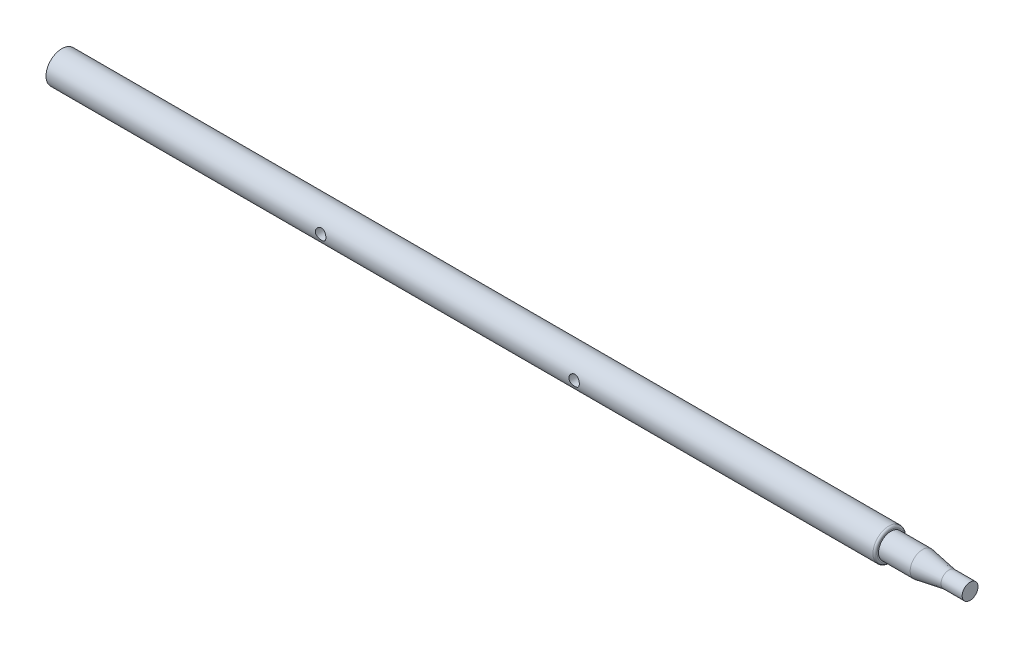
ISO-10303-21;
HEADER;
FILE_DESCRIPTION(('STEP AP214'),'2;1');
FILE_NAME('part.step','',(''),(''),'','','');
FILE_SCHEMA(('AUTOMOTIVE_DESIGN { 1 0 10303 214 1 1 1 1 }'));
ENDSEC;
DATA;
#1=APPLICATION_CONTEXT('core data for automotive mechanical design processes');
#2=APPLICATION_PROTOCOL_DEFINITION('international standard','automotive_design',2000,#1);
#3=PRODUCT_CONTEXT('',#1,'mechanical');
#4=PRODUCT('Part','Part','',(#3));
#5=PRODUCT_RELATED_PRODUCT_CATEGORY('part','',(#4));
#6=PRODUCT_DEFINITION_FORMATION('','',#4);
#7=PRODUCT_DEFINITION_CONTEXT('part definition',#1,'design');
#8=PRODUCT_DEFINITION('design','',#6,#7);
#9=PRODUCT_DEFINITION_SHAPE('','',#8);
#10=(LENGTH_UNIT() NAMED_UNIT(*) SI_UNIT(.MILLI.,.METRE.));
#11=(NAMED_UNIT(*) PLANE_ANGLE_UNIT() SI_UNIT($,.RADIAN.));
#12=(NAMED_UNIT(*) SI_UNIT($,.STERADIAN.) SOLID_ANGLE_UNIT());
#13=UNCERTAINTY_MEASURE_WITH_UNIT(LENGTH_MEASURE(1.E-05),#10,'distance_accuracy_value','');
#14=(GEOMETRIC_REPRESENTATION_CONTEXT(3) GLOBAL_UNCERTAINTY_ASSIGNED_CONTEXT((#13)) GLOBAL_UNIT_ASSIGNED_CONTEXT((#10,
#11,#12)) REPRESENTATION_CONTEXT('',''));
#15=CARTESIAN_POINT('',(0.,0.,0.));
#16=DIRECTION('',(0.,0.,1.));
#17=DIRECTION('',(1.,0.,0.));
#18=AXIS2_PLACEMENT_3D('',#15,#16,#17);
#19=CARTESIAN_POINT('',(77.2277227722772,0.,0.));
#20=DIRECTION('',(-1.,0.,0.));
#21=DIRECTION('',(0.,0.,1.));
#22=AXIS2_PLACEMENT_3D('',#19,#20,#21);
#23=PLANE('',#22);
#24=CARTESIAN_POINT('',(77.2277227722772,0.,0.));
#25=DIRECTION('',(-1.,0.,0.));
#26=DIRECTION('',(0.,0.,1.));
#27=AXIS2_PLACEMENT_3D('',#24,#25,#26);
#28=CIRCLE('',#27,7.5);
#29=CARTESIAN_POINT('',(77.2277227722772,0.,7.5));
#30=VERTEX_POINT('',#29);
#31=EDGE_CURVE('E101',#30,#30,#28,.T.);
#32=ORIENTED_EDGE('',*,*,#31,.F.);
#33=EDGE_LOOP('',(#32));
#34=FACE_BOUND('',#33,.T.);
#35=ADVANCED_FACE('F39',(#34),#23,.F.);
#36=CARTESIAN_POINT('',(-782.772277227723,0.,0.));
#37=DIRECTION('',(-1.,0.,0.));
#38=DIRECTION('',(0.,0.,1.));
#39=AXIS2_PLACEMENT_3D('',#36,#37,#38);
#40=CYLINDRICAL_SURFACE('',#39,7.5);
#41=CARTESIAN_POINT('',(57.2277227722772,0.,0.));
#42=DIRECTION('',(-1.,0.,0.));
#43=DIRECTION('',(0.,0.,1.));
#44=AXIS2_PLACEMENT_3D('',#41,#42,#43);
#45=CIRCLE('',#44,7.5);
#46=CARTESIAN_POINT('',(57.2277227722772,0.,7.5));
#47=VERTEX_POINT('',#46);
#48=EDGE_CURVE('E105',#47,#47,#45,.T.);
#49=ORIENTED_EDGE('',*,*,#48,.F.);
#50=EDGE_LOOP('',(#49));
#51=FACE_BOUND('',#50,.T.);
#52=ORIENTED_EDGE('',*,*,#31,.T.);
#53=EDGE_LOOP('',(#52));
#54=FACE_BOUND('',#53,.T.);
#55=ADVANCED_FACE('F132',(#51,#54),#40,.T.);
#56=CARTESIAN_POINT('',(57.2277227722772,0.,0.));
#57=DIRECTION('',(-1.,0.,0.));
#58=DIRECTION('',(0.,0.,1.));
#59=AXIS2_PLACEMENT_3D('',#56,#57,#58);
#60=CONICAL_SURFACE('',#59,7.5,0.167716477901566);
#61=CARTESIAN_POINT('',(32.2277227722771,0.,0.));
#62=DIRECTION('',(-1.,0.,0.));
#63=DIRECTION('',(0.,0.,1.));
#64=AXIS2_PLACEMENT_3D('',#61,#62,#63);
#65=CIRCLE('',#64,11.7326732673267);
#66=CARTESIAN_POINT('',(32.2277227722771,0.,11.7326732673267));
#67=VERTEX_POINT('',#66);
#68=EDGE_CURVE('E109',#67,#67,#65,.T.);
#69=ORIENTED_EDGE('',*,*,#68,.F.);
#70=EDGE_LOOP('',(#69));
#71=FACE_BOUND('',#70,.T.);
#72=ORIENTED_EDGE('',*,*,#48,.T.);
#73=EDGE_LOOP('',(#72));
#74=FACE_BOUND('',#73,.T.);
#75=ADVANCED_FACE('F137',(#71,#74),#60,.T.);
#76=CARTESIAN_POINT('',(-782.772277227723,0.,0.));
#77=DIRECTION('',(-1.,0.,0.));
#78=DIRECTION('',(0.,0.,1.));
#79=AXIS2_PLACEMENT_3D('',#76,#77,#78);
#80=CYLINDRICAL_SURFACE('',#79,11.7326732673267);
#81=CARTESIAN_POINT('',(2.22772277227723,0.,0.));
#82=DIRECTION('',(-1.,0.,0.));
#83=DIRECTION('',(0.,0.,1.));
#84=AXIS2_PLACEMENT_3D('',#81,#82,#83);
#85=CIRCLE('',#84,11.7326732673267);
#86=CARTESIAN_POINT('',(2.22772277227723,0.,11.7326732673267));
#87=VERTEX_POINT('',#86);
#88=EDGE_CURVE('E113',#87,#87,#85,.T.);
#89=ORIENTED_EDGE('',*,*,#88,.F.);
#90=EDGE_LOOP('',(#89));
#91=FACE_BOUND('',#90,.T.);
#92=ORIENTED_EDGE('',*,*,#68,.T.);
#93=EDGE_LOOP('',(#92));
#94=FACE_BOUND('',#93,.T.);
#95=ADVANCED_FACE('F129',(#91,#94),#80,.T.);
#96=CARTESIAN_POINT('',(2.22772277227718,11.7326732673267,0.));
#97=DIRECTION('',(-1.,0.,0.));
#98=DIRECTION('',(0.,0.,1.));
#99=AXIS2_PLACEMENT_3D('',#96,#97,#98);
#100=PLANE('',#99);
#101=CARTESIAN_POINT('',(2.22772277227718,0.,0.));
#102=DIRECTION('',(-1.,0.,0.));
#103=DIRECTION('',(0.,0.,1.));
#104=AXIS2_PLACEMENT_3D('',#101,#102,#103);
#105=CIRCLE('',#104,13.);
#106=CARTESIAN_POINT('',(2.22772277227718,0.,13.));
#107=VERTEX_POINT('',#106);
#108=EDGE_CURVE('E93',#107,#107,#105,.F.);
#109=ORIENTED_EDGE('',*,*,#108,.T.);
#110=EDGE_LOOP('',(#109));
#111=FACE_BOUND('',#110,.T.);
#112=ORIENTED_EDGE('',*,*,#88,.T.);
#113=EDGE_LOOP('',(#112));
#114=FACE_BOUND('',#113,.T.);
#115=ADVANCED_FACE('F124',(#111,#114),#100,.F.);
#116=CARTESIAN_POINT('',(-782.772277227723,0.,0.));
#117=DIRECTION('',(-1.,0.,0.));
#118=DIRECTION('',(0.,0.,1.));
#119=AXIS2_PLACEMENT_3D('',#116,#117,#118);
#120=CYLINDRICAL_SURFACE('',#119,15.);
#121=CARTESIAN_POINT('',(-517.772277227723,0.,-15.));
#122=CARTESIAN_POINT('',(-517.772275959065,0.272816814433615,-15.0000007650471));
#123=CARTESIAN_POINT('',(-517.794678558359,0.545625972692736,-14.9924884753769));
#124=CARTESIAN_POINT('',(-517.883422771809,1.08320880436491,-14.9632605101644));
#125=CARTESIAN_POINT('',(-517.949768947468,1.3479816405942,-14.941543360109));
#126=CARTESIAN_POINT('',(-518.123873444643,1.86166394750877,-14.8862653953208));
#127=CARTESIAN_POINT('',(-518.231562540019,2.11059912942978,-14.8527243865376));
#128=CARTESIAN_POINT('',(-518.484983091915,2.58687468402706,-14.7772222858721));
#129=CARTESIAN_POINT('',(-518.630722052738,2.81421078479508,-14.7352595334076));
#130=CARTESIAN_POINT('',(-518.961406252014,3.24870837510977,-14.6457047221309));
#131=CARTESIAN_POINT('',(-519.147433399017,3.45501850148558,-14.5979778231161));
#132=CARTESIAN_POINT('',(-519.551113001264,3.83416346351653,-14.5030157392292));
#133=CARTESIAN_POINT('',(-519.768772402396,4.0069909274699,-14.4557806648006));
#134=CARTESIAN_POINT('',(-520.237202803678,4.319124711119,-14.3656666235818));
#135=CARTESIAN_POINT('',(-520.488745926274,4.4573242910225,-14.3229519627198));
#136=CARTESIAN_POINT('',(-521.013157699902,4.68909436930555,-14.2487652698844));
#137=CARTESIAN_POINT('',(-521.286019813501,4.78267848691248,-14.2172898077928));
#138=CARTESIAN_POINT('',(-521.835643335234,4.91936730756491,-14.1705651637056));
#139=CARTESIAN_POINT('',(-522.111963270182,4.96406724136039,-14.1548047884338));
#140=CARTESIAN_POINT('',(-522.668595998488,5.00670561667091,-14.1397828315221));
#141=CARTESIAN_POINT('',(-522.948907531239,5.00465850803663,-14.1405161515599));
#142=CARTESIAN_POINT('',(-523.491960379984,4.95509951850361,-14.1579507500054));
#143=CARTESIAN_POINT('',(-523.754919242441,4.90966956578094,-14.1739207918415));
#144=CARTESIAN_POINT('',(-524.269244325873,4.77803081419374,-14.2188328846856));
#145=CARTESIAN_POINT('',(-524.520609154925,4.69181713294746,-14.2477764887883));
#146=CARTESIAN_POINT('',(-525.009340975643,4.47969529031774,-14.3158955569847));
#147=CARTESIAN_POINT('',(-525.24641735506,4.35317024354083,-14.3552282897692));
#148=CARTESIAN_POINT('',(-525.696631769132,4.06444553151127,-14.4396279286729));
#149=CARTESIAN_POINT('',(-525.909762862393,3.90223556181882,-14.4846964894921));
#150=CARTESIAN_POINT('',(-526.317735218524,3.53674666341248,-14.5783664584198));
#151=CARTESIAN_POINT('',(-526.511040700267,3.3317657503819,-14.6270294677509));
#152=CARTESIAN_POINT('',(-526.860933561041,2.89169784984997,-14.7203469193431));
#153=CARTESIAN_POINT('',(-527.017517418545,2.65660797830397,-14.765000976901));
#154=CARTESIAN_POINT('',(-527.290758728898,2.15973806523143,-14.8458553968921));
#155=CARTESIAN_POINT('',(-527.407004684427,1.89771638208172,-14.8819675004026));
#156=CARTESIAN_POINT('',(-527.593293097501,1.35634541682252,-14.9410283572211));
#157=CARTESIAN_POINT('',(-527.66335160484,1.07700219077475,-14.9639816827438));
#158=CARTESIAN_POINT('',(-527.752555557835,0.521919147646505,-14.9933813535722));
#159=CARTESIAN_POINT('',(-527.773776273587,0.246547999324214,-15.0005000916864));
#160=CARTESIAN_POINT('',(-527.77061385973,-0.303875349801204,-14.9994451347413));
#161=CARTESIAN_POINT('',(-527.746238427824,-0.578927596598268,-14.9912740209681));
#162=CARTESIAN_POINT('',(-527.654217689043,-1.11259933152128,-14.9610012358552));
#163=CARTESIAN_POINT('',(-527.587846197475,-1.3714640341742,-14.9393099355596));
#164=CARTESIAN_POINT('',(-527.415310005389,-1.87427979289785,-14.8845923415035));
#165=CARTESIAN_POINT('',(-527.309140230384,-2.11822894254303,-14.8515646023337));
#166=CARTESIAN_POINT('',(-527.056925068519,-2.59144148196636,-14.7764465643645));
#167=CARTESIAN_POINT('',(-526.909904261307,-2.82014979608571,-14.7341407377893));
#168=CARTESIAN_POINT('',(-526.581306477655,-3.25032415067791,-14.6452626958131));
#169=CARTESIAN_POINT('',(-526.399718947564,-3.45178183897789,-14.5986891796914));
#170=CARTESIAN_POINT('',(-525.99738347269,-3.83126253903152,-14.5038423990222));
#171=CARTESIAN_POINT('',(-525.775231093089,-4.00780484622888,-14.4555880543714));
#172=CARTESIAN_POINT('',(-525.303419388668,-4.3212876116179,-14.3649986647354));
#173=CARTESIAN_POINT('',(-525.053759834552,-4.4582277396551,-14.3226636691001));
#174=CARTESIAN_POINT('',(-524.533912151273,-4.68798465208185,-14.2491195895692));
#175=CARTESIAN_POINT('',(-524.263766831879,-4.78089066082515,-14.2178880396489));
#176=CARTESIAN_POINT('',(-523.710383977502,-4.91947333379681,-14.1705416153225));
#177=CARTESIAN_POINT('',(-523.427152400701,-4.96517127476974,-14.154419931182));
#178=CARTESIAN_POINT('',(-522.871291747518,-5.00638141238676,-14.1398929437088));
#179=CARTESIAN_POINT('',(-522.598865526289,-5.00435128654204,-14.1406200128707));
#180=CARTESIAN_POINT('',(-522.058451853112,-4.95621146724351,-14.1575634911934));
#181=CARTESIAN_POINT('',(-521.790464137947,-4.91010439729298,-14.1737789784681));
#182=CARTESIAN_POINT('',(-521.27159891271,-4.77685906564678,-14.2192262152446));
#183=CARTESIAN_POINT('',(-521.0204931027,-4.69051673007763,-14.2482049011239));
#184=CARTESIAN_POINT('',(-520.536140193032,-4.47989682879881,-14.3158199409234));
#185=CARTESIAN_POINT('',(-520.302897071783,-4.3556108427691,-14.3544584381696));
#186=CARTESIAN_POINT('',(-519.849858878108,-4.06630346291722,-14.4391414613023));
#187=CARTESIAN_POINT('',(-519.631094718231,-3.89974121382297,-14.4854355821068));
#188=CARTESIAN_POINT('',(-519.223828160802,-3.53321441567832,-14.5791678141626));
#189=CARTESIAN_POINT('',(-519.035334349282,-3.33324042225749,-14.6266062456186));
#190=CARTESIAN_POINT('',(-518.686555166277,-2.89620778460353,-14.7195015262772));
#191=CARTESIAN_POINT('',(-518.527655488968,-2.65800756749873,-14.7648090900628));
#192=CARTESIAN_POINT('',(-518.252325083469,-2.15678678703319,-14.8462995586306));
#193=CARTESIAN_POINT('',(-518.135883498113,-1.89377259066178,-14.8824847953965));
#194=CARTESIAN_POINT('',(-517.953669065279,-1.3624682360049,-14.9402757534271));
#195=CARTESIAN_POINT('',(-517.885864896406,-1.09493878838207,-14.9624606211261));
#196=CARTESIAN_POINT('',(-517.795175824337,-0.551602080051252,-14.9923203532111));
#197=CARTESIAN_POINT('',(-517.77227851024,-0.275797127843735,-14.9999992265953));
#198=CARTESIAN_POINT('',(-517.772277227723,0.,-15.));
#199=B_SPLINE_CURVE_WITH_KNOTS('',3,(#121,#122,#123,#124,#125,#126,#127,#128,#129,#130,#131,
#132,#133,#134,#135,#136,#137,#138,#139,#140,#141,#142,#143,#144,#145,#146,#147,#148,#149,#150,
#151,#152,#153,#154,#155,#156,#157,#158,#159,#160,#161,#162,#163,#164,#165,#166,#167,#168,#169,
#170,#171,#172,#173,#174,#175,#176,#177,#178,#179,#180,#181,#182,#183,#184,#185,#186,#187,#188,
#189,#190,#191,#192,#193,#194,#195,#196,#197,#198),.UNSPECIFIED.,.T.,.F.,(4,2,2,2,2,2,2,2,2,2,2,
2,2,2,2,2,2,2,2,2,2,2,2,2,2,2,2,2,2,2,2,2,2,2,2,2,2,2,4),(0.,0.817435530130066,1.63495592633762,
2.45111336435139,3.26743188899552,4.10923421413787,4.95122166437655,5.81741924118914,
6.68335223467738,7.52009628712775,8.35658169941013,9.15484132763708,9.95319654288068,
10.7644085578631,11.575855128017,12.429665290675,13.2835572984376,14.1459202826245,
15.0079834439671,15.8326791588652,16.6572356583155,17.4579078990173,18.2586822643118,
19.0805199922935,19.9026090412012,20.7620511441443,21.6215004118566,22.4792006914453,
23.3365142353987,24.1497833033197,24.9630039676755,25.7607793541275,26.5587319089055,
27.3915033346969,28.2245105562956,29.0899830418617,29.9552340577296,30.7818279187974,
31.6081933020138),.UNSPECIFIED.);
#200=CARTESIAN_POINT('',(-517.772277227723,0.,-15.));
#201=VERTEX_POINT('',#200);
#202=EDGE_CURVE('E10',#201,#201,#199,.T.);
#203=ORIENTED_EDGE('',*,*,#202,.T.);
#204=EDGE_LOOP('',(#203));
#205=FACE_BOUND('',#204,.T.);
#206=CARTESIAN_POINT('',(-517.772277227723,0.,15.));
#207=CARTESIAN_POINT('',(-517.772275959065,-0.272816814433615,15.0000007650471));
#208=CARTESIAN_POINT('',(-517.794678558359,-0.545625972692736,14.9924884753769));
#209=CARTESIAN_POINT('',(-517.883422771809,-1.08320880436491,14.9632605101644));
#210=CARTESIAN_POINT('',(-517.949768947468,-1.3479816405942,14.941543360109));
#211=CARTESIAN_POINT('',(-518.123873444643,-1.86166394750877,14.8862653953208));
#212=CARTESIAN_POINT('',(-518.231562540019,-2.11059912942978,14.8527243865376));
#213=CARTESIAN_POINT('',(-518.484983091915,-2.58687468402706,14.7772222858721));
#214=CARTESIAN_POINT('',(-518.630722052738,-2.81421078479508,14.7352595334076));
#215=CARTESIAN_POINT('',(-518.961406252014,-3.24870837510977,14.6457047221309));
#216=CARTESIAN_POINT('',(-519.147433399017,-3.45501850148558,14.5979778231161));
#217=CARTESIAN_POINT('',(-519.551113001264,-3.83416346351653,14.5030157392292));
#218=CARTESIAN_POINT('',(-519.768772402396,-4.0069909274699,14.4557806648006));
#219=CARTESIAN_POINT('',(-520.237202803678,-4.319124711119,14.3656666235818));
#220=CARTESIAN_POINT('',(-520.488745926274,-4.4573242910225,14.3229519627198));
#221=CARTESIAN_POINT('',(-521.013157699902,-4.68909436930555,14.2487652698844));
#222=CARTESIAN_POINT('',(-521.286019813501,-4.78267848691248,14.2172898077928));
#223=CARTESIAN_POINT('',(-521.835643335234,-4.91936730756491,14.1705651637056));
#224=CARTESIAN_POINT('',(-522.111963270182,-4.96406724136039,14.1548047884338));
#225=CARTESIAN_POINT('',(-522.668595998488,-5.00670561667091,14.1397828315221));
#226=CARTESIAN_POINT('',(-522.948907531239,-5.00465850803663,14.1405161515599));
#227=CARTESIAN_POINT('',(-523.491960379984,-4.95509951850361,14.1579507500054));
#228=CARTESIAN_POINT('',(-523.754919242441,-4.90966956578094,14.1739207918415));
#229=CARTESIAN_POINT('',(-524.269244325873,-4.77803081419374,14.2188328846856));
#230=CARTESIAN_POINT('',(-524.520609154925,-4.69181713294746,14.2477764887883));
#231=CARTESIAN_POINT('',(-525.009340975643,-4.47969529031774,14.3158955569847));
#232=CARTESIAN_POINT('',(-525.24641735506,-4.35317024354083,14.3552282897692));
#233=CARTESIAN_POINT('',(-525.696631769132,-4.06444553151127,14.4396279286729));
#234=CARTESIAN_POINT('',(-525.909762862393,-3.90223556181882,14.4846964894921));
#235=CARTESIAN_POINT('',(-526.317735218524,-3.53674666341248,14.5783664584198));
#236=CARTESIAN_POINT('',(-526.511040700267,-3.3317657503819,14.6270294677509));
#237=CARTESIAN_POINT('',(-526.860933561041,-2.89169784984997,14.7203469193431));
#238=CARTESIAN_POINT('',(-527.017517418545,-2.65660797830397,14.765000976901));
#239=CARTESIAN_POINT('',(-527.290758728898,-2.15973806523143,14.8458553968921));
#240=CARTESIAN_POINT('',(-527.407004684427,-1.89771638208172,14.8819675004026));
#241=CARTESIAN_POINT('',(-527.593293097501,-1.35634541682252,14.9410283572211));
#242=CARTESIAN_POINT('',(-527.66335160484,-1.07700219077475,14.9639816827438));
#243=CARTESIAN_POINT('',(-527.752555557835,-0.521919147646505,14.9933813535722));
#244=CARTESIAN_POINT('',(-527.773776273587,-0.246547999324214,15.0005000916864));
#245=CARTESIAN_POINT('',(-527.77061385973,0.303875349801204,14.9994451347413));
#246=CARTESIAN_POINT('',(-527.746238427824,0.578927596598268,14.9912740209681));
#247=CARTESIAN_POINT('',(-527.654217689043,1.11259933152128,14.9610012358552));
#248=CARTESIAN_POINT('',(-527.587846197475,1.3714640341742,14.9393099355596));
#249=CARTESIAN_POINT('',(-527.415310005389,1.87427979289785,14.8845923415035));
#250=CARTESIAN_POINT('',(-527.309140230384,2.11822894254303,14.8515646023337));
#251=CARTESIAN_POINT('',(-527.056925068519,2.59144148196636,14.7764465643645));
#252=CARTESIAN_POINT('',(-526.909904261307,2.82014979608571,14.7341407377893));
#253=CARTESIAN_POINT('',(-526.581306477655,3.25032415067791,14.6452626958131));
#254=CARTESIAN_POINT('',(-526.399718947564,3.45178183897789,14.5986891796914));
#255=CARTESIAN_POINT('',(-525.99738347269,3.83126253903152,14.5038423990222));
#256=CARTESIAN_POINT('',(-525.775231093089,4.00780484622888,14.4555880543714));
#257=CARTESIAN_POINT('',(-525.303419388668,4.3212876116179,14.3649986647354));
#258=CARTESIAN_POINT('',(-525.053759834552,4.4582277396551,14.3226636691001));
#259=CARTESIAN_POINT('',(-524.533912151273,4.68798465208185,14.2491195895692));
#260=CARTESIAN_POINT('',(-524.263766831879,4.78089066082515,14.2178880396489));
#261=CARTESIAN_POINT('',(-523.710383977502,4.91947333379681,14.1705416153225));
#262=CARTESIAN_POINT('',(-523.427152400701,4.96517127476974,14.154419931182));
#263=CARTESIAN_POINT('',(-522.871291747518,5.00638141238676,14.1398929437088));
#264=CARTESIAN_POINT('',(-522.598865526289,5.00435128654204,14.1406200128707));
#265=CARTESIAN_POINT('',(-522.058451853112,4.95621146724351,14.1575634911934));
#266=CARTESIAN_POINT('',(-521.790464137947,4.91010439729298,14.1737789784681));
#267=CARTESIAN_POINT('',(-521.27159891271,4.77685906564678,14.2192262152446));
#268=CARTESIAN_POINT('',(-521.0204931027,4.69051673007763,14.2482049011239));
#269=CARTESIAN_POINT('',(-520.536140193032,4.47989682879881,14.3158199409234));
#270=CARTESIAN_POINT('',(-520.302897071783,4.3556108427691,14.3544584381696));
#271=CARTESIAN_POINT('',(-519.849858878108,4.06630346291722,14.4391414613023));
#272=CARTESIAN_POINT('',(-519.631094718231,3.89974121382297,14.4854355821068));
#273=CARTESIAN_POINT('',(-519.223828160802,3.53321441567832,14.5791678141626));
#274=CARTESIAN_POINT('',(-519.035334349282,3.33324042225749,14.6266062456186));
#275=CARTESIAN_POINT('',(-518.686555166277,2.89620778460353,14.7195015262772));
#276=CARTESIAN_POINT('',(-518.527655488968,2.65800756749873,14.7648090900628));
#277=CARTESIAN_POINT('',(-518.252325083469,2.15678678703319,14.8462995586306));
#278=CARTESIAN_POINT('',(-518.135883498113,1.89377259066178,14.8824847953965));
#279=CARTESIAN_POINT('',(-517.953669065279,1.3624682360049,14.9402757534271));
#280=CARTESIAN_POINT('',(-517.885864896406,1.09493878838207,14.9624606211261));
#281=CARTESIAN_POINT('',(-517.795175824337,0.551602080051252,14.9923203532111));
#282=CARTESIAN_POINT('',(-517.77227851024,0.275797127843735,14.9999992265953));
#283=CARTESIAN_POINT('',(-517.772277227723,0.,15.));
#284=B_SPLINE_CURVE_WITH_KNOTS('',3,(#206,#207,#208,#209,#210,#211,#212,#213,#214,#215,#216,
#217,#218,#219,#220,#221,#222,#223,#224,#225,#226,#227,#228,#229,#230,#231,#232,#233,#234,#235,
#236,#237,#238,#239,#240,#241,#242,#243,#244,#245,#246,#247,#248,#249,#250,#251,#252,#253,#254,
#255,#256,#257,#258,#259,#260,#261,#262,#263,#264,#265,#266,#267,#268,#269,#270,#271,#272,#273,
#274,#275,#276,#277,#278,#279,#280,#281,#282,#283),.UNSPECIFIED.,.T.,.F.,(4,2,2,2,2,2,2,2,2,2,2,
2,2,2,2,2,2,2,2,2,2,2,2,2,2,2,2,2,2,2,2,2,2,2,2,2,2,2,4),(0.,0.817435530130066,1.63495592633762,
2.45111336435139,3.26743188899552,4.10923421413787,4.95122166437655,5.81741924118914,
6.68335223467738,7.52009628712775,8.35658169941013,9.15484132763708,9.95319654288068,
10.7644085578631,11.575855128017,12.429665290675,13.2835572984376,14.1459202826245,
15.0079834439671,15.8326791588652,16.6572356583155,17.4579078990173,18.2586822643118,
19.0805199922935,19.9026090412012,20.7620511441443,21.6215004118566,22.4792006914453,
23.3365142353987,24.1497833033197,24.9630039676755,25.7607793541275,26.5587319089055,
27.3915033346969,28.2245105562956,29.0899830418617,29.9552340577296,30.7818279187974,
31.6081933020138),.UNSPECIFIED.);
#285=CARTESIAN_POINT('',(-517.772277227723,0.,15.));
#286=VERTEX_POINT('',#285);
#287=EDGE_CURVE('E52',#286,#286,#284,.T.);
#288=ORIENTED_EDGE('',*,*,#287,.T.);
#289=EDGE_LOOP('',(#288));
#290=FACE_BOUND('',#289,.T.);
#291=CARTESIAN_POINT('',(-277.772277227723,0.,-15.));
#292=CARTESIAN_POINT('',(-277.772275959065,0.27281681443361,-15.0000007650471));
#293=CARTESIAN_POINT('',(-277.794678558359,0.545625972692724,-14.9924884753769));
#294=CARTESIAN_POINT('',(-277.883422771809,1.0832088043649,-14.9632605101644));
#295=CARTESIAN_POINT('',(-277.949768947468,1.3479816405942,-14.941543360109));
#296=CARTESIAN_POINT('',(-278.123873444643,1.86166394750877,-14.8862653953208));
#297=CARTESIAN_POINT('',(-278.231562540019,2.11059912942975,-14.8527243865377));
#298=CARTESIAN_POINT('',(-278.484983091915,2.58687468402703,-14.7772222858721));
#299=CARTESIAN_POINT('',(-278.630722052738,2.81421078479507,-14.7352595334076));
#300=CARTESIAN_POINT('',(-278.961406252014,3.24870837510975,-14.6457047221309));
#301=CARTESIAN_POINT('',(-279.147433399017,3.45501850148554,-14.5979778231161));
#302=CARTESIAN_POINT('',(-279.551113001264,3.83416346351647,-14.5030157392292));
#303=CARTESIAN_POINT('',(-279.768772402396,4.00699092746985,-14.4557806648007));
#304=CARTESIAN_POINT('',(-280.237202803678,4.31912471111898,-14.3656666235818));
#305=CARTESIAN_POINT('',(-280.488745926274,4.45732429102251,-14.3229519627198));
#306=CARTESIAN_POINT('',(-281.013157699902,4.68909436930556,-14.2487652698844));
#307=CARTESIAN_POINT('',(-281.286019813501,4.78267848691246,-14.2172898077928));
#308=CARTESIAN_POINT('',(-281.835643335234,4.91936730756487,-14.1705651637056));
#309=CARTESIAN_POINT('',(-282.111963270183,4.96406724136035,-14.1548047884338));
#310=CARTESIAN_POINT('',(-282.668595998488,5.00670561667086,-14.1397828315221));
#311=CARTESIAN_POINT('',(-282.948907531239,5.00465850803657,-14.1405161515599));
#312=CARTESIAN_POINT('',(-283.491960379984,4.95509951850356,-14.1579507500054));
#313=CARTESIAN_POINT('',(-283.754919242441,4.90966956578088,-14.1739207918415));
#314=CARTESIAN_POINT('',(-284.269244325873,4.77803081419366,-14.2188328846856));
#315=CARTESIAN_POINT('',(-284.520609154925,4.69181713294738,-14.2477764887883));
#316=CARTESIAN_POINT('',(-285.009340975642,4.47969529031769,-14.3158955569848));
#317=CARTESIAN_POINT('',(-285.24641735506,4.35317024354079,-14.3552282897692));
#318=CARTESIAN_POINT('',(-285.696631769131,4.06444553151124,-14.4396279286729));
#319=CARTESIAN_POINT('',(-285.909762862392,3.90223556181881,-14.4846964894921));
#320=CARTESIAN_POINT('',(-286.317735218524,3.53674666341247,-14.5783664584198));
#321=CARTESIAN_POINT('',(-286.511040700267,3.33176575038189,-14.6270294677509));
#322=CARTESIAN_POINT('',(-286.860933561041,2.89169784984997,-14.7203469193431));
#323=CARTESIAN_POINT('',(-287.017517418545,2.65660797830397,-14.765000976901));
#324=CARTESIAN_POINT('',(-287.290758728898,2.15973806523143,-14.8458553968921));
#325=CARTESIAN_POINT('',(-287.407004684426,1.89771638208171,-14.8819675004026));
#326=CARTESIAN_POINT('',(-287.593293097501,1.35634541682252,-14.9410283572211));
#327=CARTESIAN_POINT('',(-287.66335160484,1.07700219077477,-14.9639816827438));
#328=CARTESIAN_POINT('',(-287.752555557835,0.521919147646529,-14.9933813535722));
#329=CARTESIAN_POINT('',(-287.773776273587,0.246547999324234,-15.0005000916864));
#330=CARTESIAN_POINT('',(-287.77061385973,-0.303875349801188,-14.9994451347413));
#331=CARTESIAN_POINT('',(-287.746238427823,-0.57892759659825,-14.9912740209681));
#332=CARTESIAN_POINT('',(-287.654217689043,-1.11259933152129,-14.9610012358552));
#333=CARTESIAN_POINT('',(-287.587846197475,-1.37146403417424,-14.9393099355596));
#334=CARTESIAN_POINT('',(-287.415310005389,-1.87427979289789,-14.8845923415035));
#335=CARTESIAN_POINT('',(-287.309140230384,-2.11822894254304,-14.8515646023337));
#336=CARTESIAN_POINT('',(-287.056925068519,-2.59144148196636,-14.7764465643645));
#337=CARTESIAN_POINT('',(-286.909904261307,-2.82014979608573,-14.7341407377893));
#338=CARTESIAN_POINT('',(-286.581306477655,-3.25032415067793,-14.6452626958131));
#339=CARTESIAN_POINT('',(-286.399718947564,-3.45178183897787,-14.5986891796914));
#340=CARTESIAN_POINT('',(-285.99738347269,-3.83126253903148,-14.5038423990222));
#341=CARTESIAN_POINT('',(-285.775231093089,-4.00780484622885,-14.4555880543714));
#342=CARTESIAN_POINT('',(-285.303419388668,-4.32128761161787,-14.3649986647354));
#343=CARTESIAN_POINT('',(-285.053759834552,-4.45822773965505,-14.3226636691001));
#344=CARTESIAN_POINT('',(-284.533912151273,-4.68798465208179,-14.2491195895692));
#345=CARTESIAN_POINT('',(-284.263766831879,-4.78089066082509,-14.2178880396489));
#346=CARTESIAN_POINT('',(-283.710383977502,-4.91947333379677,-14.1705416153225));
#347=CARTESIAN_POINT('',(-283.427152400701,-4.96517127476969,-14.154419931182));
#348=CARTESIAN_POINT('',(-282.871291747518,-5.0063814123867,-14.1398929437089));
#349=CARTESIAN_POINT('',(-282.598865526289,-5.00435128654198,-14.1406200128708));
#350=CARTESIAN_POINT('',(-282.058451853113,-4.95621146724346,-14.1575634911934));
#351=CARTESIAN_POINT('',(-281.790464137947,-4.91010439729292,-14.1737789784681));
#352=CARTESIAN_POINT('',(-281.27159891271,-4.77685906564672,-14.2192262152446));
#353=CARTESIAN_POINT('',(-281.0204931027,-4.69051673007756,-14.2482049011239));
#354=CARTESIAN_POINT('',(-280.536140193031,-4.47989682879871,-14.3158199409234));
#355=CARTESIAN_POINT('',(-280.302897071783,-4.355610842769,-14.3544584381697));
#356=CARTESIAN_POINT('',(-279.849858878108,-4.06630346291712,-14.4391414613023));
#357=CARTESIAN_POINT('',(-279.631094718231,-3.89974121382288,-14.4854355821069));
#358=CARTESIAN_POINT('',(-279.223828160802,-3.53321441567824,-14.5791678141626));
#359=CARTESIAN_POINT('',(-279.035334349282,-3.3332404222574,-14.6266062456186));
#360=CARTESIAN_POINT('',(-278.686555166277,-2.89620778460344,-14.7195015262772));
#361=CARTESIAN_POINT('',(-278.527655488968,-2.65800756749865,-14.7648090900628));
#362=CARTESIAN_POINT('',(-278.25232508347,-2.15678678703312,-14.8462995586306));
#363=CARTESIAN_POINT('',(-278.135883498113,-1.89377259066174,-14.8824847953965));
#364=CARTESIAN_POINT('',(-277.953669065279,-1.36246823600487,-14.9402757534271));
#365=CARTESIAN_POINT('',(-277.885864896406,-1.09493878838204,-14.9624606211261));
#366=CARTESIAN_POINT('',(-277.795175824337,-0.551602080051228,-14.9923203532111));
#367=CARTESIAN_POINT('',(-277.77227851024,-0.275797127843722,-14.9999992265953));
#368=CARTESIAN_POINT('',(-277.772277227723,0.,-15.));
#369=B_SPLINE_CURVE_WITH_KNOTS('',3,(#291,#292,#293,#294,#295,#296,#297,#298,#299,#300,#301,
#302,#303,#304,#305,#306,#307,#308,#309,#310,#311,#312,#313,#314,#315,#316,#317,#318,#319,#320,
#321,#322,#323,#324,#325,#326,#327,#328,#329,#330,#331,#332,#333,#334,#335,#336,#337,#338,#339,
#340,#341,#342,#343,#344,#345,#346,#347,#348,#349,#350,#351,#352,#353,#354,#355,#356,#357,#358,
#359,#360,#361,#362,#363,#364,#365,#366,#367,#368),.UNSPECIFIED.,.T.,.F.,(4,2,2,2,2,2,2,2,2,2,2,
2,2,2,2,2,2,2,2,2,2,2,2,2,2,2,2,2,2,2,2,2,2,2,2,2,2,2,4),(0.,0.81743553013006,1.63495592633761,
2.45111336435138,3.26743188899552,4.10923421413784,4.95122166437652,5.81741924118919,
6.68335223467747,7.52009628712783,8.35658169941005,9.15484132763712,9.95319654288055,
10.764408557863,11.5758551280168,12.4296652906748,13.2835572984374,14.1459202826243,
15.0079834439669,15.8326791588649,16.6572356583153,17.4579078990172,18.2586822643117,
19.0805199922933,19.902609041201,20.762051144144,21.6215004118563,22.479200691445,
23.3365142353985,24.1497833033193,24.9630039676752,25.7607793541273,26.5587319089054,
27.3915033346967,28.2245105562954,29.0899830418615,29.9552340577293,30.7818279187971,
31.6081933020134),.UNSPECIFIED.);
#370=CARTESIAN_POINT('',(-277.772277227723,0.,-15.));
#371=VERTEX_POINT('',#370);
#372=EDGE_CURVE('E57',#371,#371,#369,.T.);
#373=ORIENTED_EDGE('',*,*,#372,.T.);
#374=EDGE_LOOP('',(#373));
#375=FACE_BOUND('',#374,.T.);
#376=CARTESIAN_POINT('',(-277.772277227723,0.,15.));
#377=CARTESIAN_POINT('',(-277.772275959065,-0.27281681443361,15.0000007650471));
#378=CARTESIAN_POINT('',(-277.794678558359,-0.545625972692724,14.9924884753769));
#379=CARTESIAN_POINT('',(-277.883422771809,-1.0832088043649,14.9632605101644));
#380=CARTESIAN_POINT('',(-277.949768947468,-1.3479816405942,14.941543360109));
#381=CARTESIAN_POINT('',(-278.123873444643,-1.86166394750877,14.8862653953208));
#382=CARTESIAN_POINT('',(-278.231562540019,-2.11059912942975,14.8527243865377));
#383=CARTESIAN_POINT('',(-278.484983091915,-2.58687468402703,14.7772222858721));
#384=CARTESIAN_POINT('',(-278.630722052738,-2.81421078479507,14.7352595334076));
#385=CARTESIAN_POINT('',(-278.961406252014,-3.24870837510975,14.6457047221309));
#386=CARTESIAN_POINT('',(-279.147433399017,-3.45501850148554,14.5979778231161));
#387=CARTESIAN_POINT('',(-279.551113001264,-3.83416346351647,14.5030157392292));
#388=CARTESIAN_POINT('',(-279.768772402396,-4.00699092746985,14.4557806648007));
#389=CARTESIAN_POINT('',(-280.237202803678,-4.31912471111898,14.3656666235818));
#390=CARTESIAN_POINT('',(-280.488745926274,-4.45732429102251,14.3229519627198));
#391=CARTESIAN_POINT('',(-281.013157699902,-4.68909436930556,14.2487652698844));
#392=CARTESIAN_POINT('',(-281.286019813501,-4.78267848691246,14.2172898077928));
#393=CARTESIAN_POINT('',(-281.835643335234,-4.91936730756487,14.1705651637056));
#394=CARTESIAN_POINT('',(-282.111963270183,-4.96406724136035,14.1548047884338));
#395=CARTESIAN_POINT('',(-282.668595998488,-5.00670561667086,14.1397828315221));
#396=CARTESIAN_POINT('',(-282.948907531239,-5.00465850803657,14.1405161515599));
#397=CARTESIAN_POINT('',(-283.491960379984,-4.95509951850356,14.1579507500054));
#398=CARTESIAN_POINT('',(-283.754919242441,-4.90966956578088,14.1739207918415));
#399=CARTESIAN_POINT('',(-284.269244325873,-4.77803081419366,14.2188328846856));
#400=CARTESIAN_POINT('',(-284.520609154925,-4.69181713294738,14.2477764887883));
#401=CARTESIAN_POINT('',(-285.009340975642,-4.47969529031769,14.3158955569848));
#402=CARTESIAN_POINT('',(-285.24641735506,-4.35317024354079,14.3552282897692));
#403=CARTESIAN_POINT('',(-285.696631769131,-4.06444553151124,14.4396279286729));
#404=CARTESIAN_POINT('',(-285.909762862392,-3.90223556181881,14.4846964894921));
#405=CARTESIAN_POINT('',(-286.317735218524,-3.53674666341247,14.5783664584198));
#406=CARTESIAN_POINT('',(-286.511040700267,-3.33176575038189,14.6270294677509));
#407=CARTESIAN_POINT('',(-286.860933561041,-2.89169784984997,14.7203469193431));
#408=CARTESIAN_POINT('',(-287.017517418545,-2.65660797830397,14.765000976901));
#409=CARTESIAN_POINT('',(-287.290758728898,-2.15973806523143,14.8458553968921));
#410=CARTESIAN_POINT('',(-287.407004684426,-1.89771638208171,14.8819675004026));
#411=CARTESIAN_POINT('',(-287.593293097501,-1.35634541682252,14.9410283572211));
#412=CARTESIAN_POINT('',(-287.66335160484,-1.07700219077477,14.9639816827438));
#413=CARTESIAN_POINT('',(-287.752555557835,-0.521919147646529,14.9933813535722));
#414=CARTESIAN_POINT('',(-287.773776273587,-0.246547999324234,15.0005000916864));
#415=CARTESIAN_POINT('',(-287.77061385973,0.303875349801188,14.9994451347413));
#416=CARTESIAN_POINT('',(-287.746238427823,0.57892759659825,14.9912740209681));
#417=CARTESIAN_POINT('',(-287.654217689043,1.11259933152129,14.9610012358552));
#418=CARTESIAN_POINT('',(-287.587846197475,1.37146403417424,14.9393099355596));
#419=CARTESIAN_POINT('',(-287.415310005389,1.87427979289789,14.8845923415035));
#420=CARTESIAN_POINT('',(-287.309140230384,2.11822894254304,14.8515646023337));
#421=CARTESIAN_POINT('',(-287.056925068519,2.59144148196636,14.7764465643645));
#422=CARTESIAN_POINT('',(-286.909904261307,2.82014979608573,14.7341407377893));
#423=CARTESIAN_POINT('',(-286.581306477655,3.25032415067793,14.6452626958131));
#424=CARTESIAN_POINT('',(-286.399718947564,3.45178183897787,14.5986891796914));
#425=CARTESIAN_POINT('',(-285.99738347269,3.83126253903148,14.5038423990222));
#426=CARTESIAN_POINT('',(-285.775231093089,4.00780484622885,14.4555880543714));
#427=CARTESIAN_POINT('',(-285.303419388668,4.32128761161787,14.3649986647354));
#428=CARTESIAN_POINT('',(-285.053759834552,4.45822773965505,14.3226636691001));
#429=CARTESIAN_POINT('',(-284.533912151273,4.68798465208179,14.2491195895692));
#430=CARTESIAN_POINT('',(-284.263766831879,4.78089066082509,14.2178880396489));
#431=CARTESIAN_POINT('',(-283.710383977502,4.91947333379677,14.1705416153225));
#432=CARTESIAN_POINT('',(-283.427152400701,4.96517127476969,14.154419931182));
#433=CARTESIAN_POINT('',(-282.871291747518,5.0063814123867,14.1398929437089));
#434=CARTESIAN_POINT('',(-282.598865526289,5.00435128654198,14.1406200128708));
#435=CARTESIAN_POINT('',(-282.058451853113,4.95621146724346,14.1575634911934));
#436=CARTESIAN_POINT('',(-281.790464137947,4.91010439729292,14.1737789784681));
#437=CARTESIAN_POINT('',(-281.27159891271,4.77685906564672,14.2192262152446));
#438=CARTESIAN_POINT('',(-281.0204931027,4.69051673007756,14.2482049011239));
#439=CARTESIAN_POINT('',(-280.536140193031,4.47989682879871,14.3158199409234));
#440=CARTESIAN_POINT('',(-280.302897071783,4.355610842769,14.3544584381697));
#441=CARTESIAN_POINT('',(-279.849858878108,4.06630346291712,14.4391414613023));
#442=CARTESIAN_POINT('',(-279.631094718231,3.89974121382288,14.4854355821069));
#443=CARTESIAN_POINT('',(-279.223828160802,3.53321441567824,14.5791678141626));
#444=CARTESIAN_POINT('',(-279.035334349282,3.3332404222574,14.6266062456186));
#445=CARTESIAN_POINT('',(-278.686555166277,2.89620778460344,14.7195015262772));
#446=CARTESIAN_POINT('',(-278.527655488968,2.65800756749865,14.7648090900628));
#447=CARTESIAN_POINT('',(-278.25232508347,2.15678678703312,14.8462995586306));
#448=CARTESIAN_POINT('',(-278.135883498113,1.89377259066174,14.8824847953965));
#449=CARTESIAN_POINT('',(-277.953669065279,1.36246823600487,14.9402757534271));
#450=CARTESIAN_POINT('',(-277.885864896406,1.09493878838204,14.9624606211261));
#451=CARTESIAN_POINT('',(-277.795175824337,0.551602080051228,14.9923203532111));
#452=CARTESIAN_POINT('',(-277.77227851024,0.275797127843722,14.9999992265953));
#453=CARTESIAN_POINT('',(-277.772277227723,0.,15.));
#454=B_SPLINE_CURVE_WITH_KNOTS('',3,(#376,#377,#378,#379,#380,#381,#382,#383,#384,#385,#386,
#387,#388,#389,#390,#391,#392,#393,#394,#395,#396,#397,#398,#399,#400,#401,#402,#403,#404,#405,
#406,#407,#408,#409,#410,#411,#412,#413,#414,#415,#416,#417,#418,#419,#420,#421,#422,#423,#424,
#425,#426,#427,#428,#429,#430,#431,#432,#433,#434,#435,#436,#437,#438,#439,#440,#441,#442,#443,
#444,#445,#446,#447,#448,#449,#450,#451,#452,#453),.UNSPECIFIED.,.T.,.F.,(4,2,2,2,2,2,2,2,2,2,2,
2,2,2,2,2,2,2,2,2,2,2,2,2,2,2,2,2,2,2,2,2,2,2,2,2,2,2,4),(0.,0.81743553013006,1.63495592633761,
2.45111336435138,3.26743188899552,4.10923421413784,4.95122166437652,5.81741924118919,
6.68335223467747,7.52009628712783,8.35658169941005,9.15484132763712,9.95319654288055,
10.764408557863,11.5758551280168,12.4296652906748,13.2835572984374,14.1459202826243,
15.0079834439669,15.8326791588649,16.6572356583153,17.4579078990172,18.2586822643117,
19.0805199922933,19.902609041201,20.762051144144,21.6215004118563,22.479200691445,
23.3365142353985,24.1497833033193,24.9630039676752,25.7607793541273,26.5587319089054,
27.3915033346967,28.2245105562954,29.0899830418615,29.9552340577293,30.7818279187971,
31.6081933020134),.UNSPECIFIED.);
#455=CARTESIAN_POINT('',(-277.772277227723,0.,15.));
#456=VERTEX_POINT('',#455);
#457=EDGE_CURVE('E62',#456,#456,#454,.T.);
#458=ORIENTED_EDGE('',*,*,#457,.T.);
#459=EDGE_LOOP('',(#458));
#460=FACE_BOUND('',#459,.T.);
#461=CARTESIAN_POINT('',(0.227722772277228,0.,0.));
#462=DIRECTION('',(-1.,0.,0.));
#463=DIRECTION('',(0.,0.,1.));
#464=AXIS2_PLACEMENT_3D('',#461,#462,#463);
#465=CIRCLE('',#464,15.);
#466=CARTESIAN_POINT('',(0.227722772277228,0.,15.));
#467=VERTEX_POINT('',#466);
#468=EDGE_CURVE('E97',#467,#467,#465,.T.);
#469=ORIENTED_EDGE('',*,*,#468,.T.);
#470=EDGE_LOOP('',(#469));
#471=FACE_BOUND('',#470,.T.);
#472=CARTESIAN_POINT('',(-782.772277227723,0.,0.));
#473=DIRECTION('',(-1.,0.,0.));
#474=DIRECTION('',(0.,0.,1.));
#475=AXIS2_PLACEMENT_3D('',#472,#473,#474);
#476=CIRCLE('',#475,15.);
#477=CARTESIAN_POINT('',(-782.772277227723,0.,15.));
#478=VERTEX_POINT('',#477);
#479=EDGE_CURVE('E117',#478,#478,#476,.T.);
#480=ORIENTED_EDGE('',*,*,#479,.F.);
#481=EDGE_LOOP('',(#480));
#482=FACE_BOUND('',#481,.T.);
#483=ADVANCED_FACE('F72',(#205,#290,#375,#460,#471,#482),#120,.T.);
#484=CARTESIAN_POINT('',(-782.772277227723,0.,0.));
#485=DIRECTION('',(1.,0.,0.));
#486=DIRECTION('',(0.,0.,-1.));
#487=AXIS2_PLACEMENT_3D('',#484,#485,#486);
#488=PLANE('',#487);
#489=ORIENTED_EDGE('',*,*,#479,.T.);
#490=EDGE_LOOP('',(#489));
#491=FACE_BOUND('',#490,.T.);
#492=ADVANCED_FACE('F85',(#491),#488,.F.);
#493=CARTESIAN_POINT('',(0.227722772277228,0.,0.));
#494=DIRECTION('',(-1.,0.,0.));
#495=DIRECTION('',(0.,0.,1.));
#496=AXIS2_PLACEMENT_3D('',#493,#494,#495);
#497=TOROIDAL_SURFACE('',#496,13.,2.);
#498=ORIENTED_EDGE('',*,*,#108,.F.);
#499=EDGE_LOOP('',(#498));
#500=FACE_BOUND('',#499,.T.);
#501=ORIENTED_EDGE('',*,*,#468,.F.);
#502=EDGE_LOOP('',(#501));
#503=FACE_BOUND('',#502,.T.);
#504=ADVANCED_FACE('F41',(#500,#503),#497,.T.);
#505=CARTESIAN_POINT('',(-282.772277227723,0.,-15.));
#506=DIRECTION('',(0.,0.,1.));
#507=DIRECTION('',(1.,0.,0.));
#508=AXIS2_PLACEMENT_3D('',#505,#506,#507);
#509=CYLINDRICAL_SURFACE('',#508,4.99999999999999);
#510=ORIENTED_EDGE('',*,*,#372,.F.);
#511=EDGE_LOOP('',(#510));
#512=FACE_BOUND('',#511,.T.);
#513=ORIENTED_EDGE('',*,*,#457,.F.);
#514=EDGE_LOOP('',(#513));
#515=FACE_BOUND('',#514,.T.);
#516=ADVANCED_FACE('F79',(#512,#515),#509,.F.);
#517=CARTESIAN_POINT('',(-522.772277227723,0.,-15.));
#518=DIRECTION('',(0.,0.,1.));
#519=DIRECTION('',(1.,0.,0.));
#520=AXIS2_PLACEMENT_3D('',#517,#518,#519);
#521=CYLINDRICAL_SURFACE('',#520,5.00000000000004);
#522=ORIENTED_EDGE('',*,*,#202,.F.);
#523=EDGE_LOOP('',(#522));
#524=FACE_BOUND('',#523,.T.);
#525=ORIENTED_EDGE('',*,*,#287,.F.);
#526=EDGE_LOOP('',(#525));
#527=FACE_BOUND('',#526,.T.);
#528=ADVANCED_FACE('F76',(#524,#527),#521,.F.);
#529=CLOSED_SHELL('',(#35,#55,#75,#95,#115,#483,#492,#504,#516,#528));
#530=MANIFOLD_SOLID_BREP('B2',#529);
#531=ADVANCED_BREP_SHAPE_REPRESENTATION('',(#18,#530),#14);
#532=SHAPE_DEFINITION_REPRESENTATION(#9,#531);
ENDSEC;
END-ISO-10303-21;
